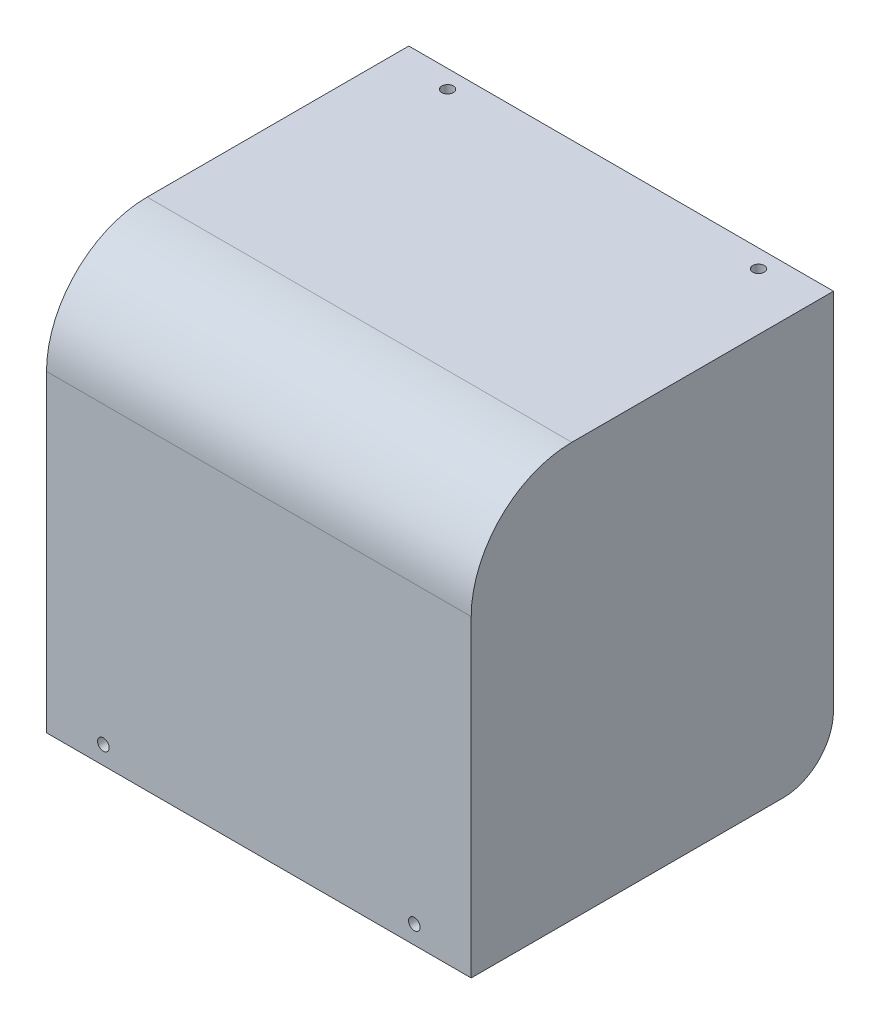
ISO-10303-21;
HEADER;
FILE_DESCRIPTION(('STEP AP214'),'2;1');
FILE_NAME('part.step','',(''),(''),'','','');
FILE_SCHEMA(('AUTOMOTIVE_DESIGN { 1 0 10303 214 1 1 1 1 }'));
ENDSEC;
DATA;
#1=APPLICATION_CONTEXT('core data for automotive mechanical design processes');
#2=APPLICATION_PROTOCOL_DEFINITION('international standard','automotive_design',2000,#1);
#3=PRODUCT_CONTEXT('',#1,'mechanical');
#4=PRODUCT('Part','Part','',(#3));
#5=PRODUCT_RELATED_PRODUCT_CATEGORY('part','',(#4));
#6=PRODUCT_DEFINITION_FORMATION('','',#4);
#7=PRODUCT_DEFINITION_CONTEXT('part definition',#1,'design');
#8=PRODUCT_DEFINITION('design','',#6,#7);
#9=PRODUCT_DEFINITION_SHAPE('','',#8);
#10=(LENGTH_UNIT() NAMED_UNIT(*) SI_UNIT(.MILLI.,.METRE.));
#11=(NAMED_UNIT(*) PLANE_ANGLE_UNIT() SI_UNIT($,.RADIAN.));
#12=(NAMED_UNIT(*) SI_UNIT($,.STERADIAN.) SOLID_ANGLE_UNIT());
#13=UNCERTAINTY_MEASURE_WITH_UNIT(LENGTH_MEASURE(1.E-05),#10,'distance_accuracy_value','');
#14=(GEOMETRIC_REPRESENTATION_CONTEXT(3) GLOBAL_UNCERTAINTY_ASSIGNED_CONTEXT((#13)) GLOBAL_UNIT_ASSIGNED_CONTEXT((#10,
#11,#12)) REPRESENTATION_CONTEXT('',''));
#15=CARTESIAN_POINT('',(0.,0.,0.));
#16=DIRECTION('',(0.,0.,1.));
#17=DIRECTION('',(1.,0.,0.));
#18=AXIS2_PLACEMENT_3D('',#15,#16,#17);
#19=CARTESIAN_POINT('',(42.2,80.2,-1.99999999999999));
#20=DIRECTION('',(0.,0.,1.));
#21=DIRECTION('',(0.,-1.,0.));
#22=AXIS2_PLACEMENT_3D('',#19,#20,#21);
#23=PLANE('',#22);
#24=CARTESIAN_POINT('',(-30.9,3.64,-2.));
#25=DIRECTION('',(0.,0.,1.));
#26=DIRECTION('',(0.,-1.,0.));
#27=AXIS2_PLACEMENT_3D('',#24,#25,#26);
#28=CIRCLE('',#27,1.15);
#29=CARTESIAN_POINT('',(-30.9,2.49,-2.));
#30=VERTEX_POINT('',#29);
#31=EDGE_CURVE('E218',#30,#30,#28,.T.);
#32=ORIENTED_EDGE('',*,*,#31,.T.);
#33=EDGE_LOOP('',(#32));
#34=FACE_BOUND('',#33,.T.);
#35=CARTESIAN_POINT('',(30.9,3.64000000000001,-2.));
#36=DIRECTION('',(0.,0.,1.));
#37=DIRECTION('',(0.,-1.,0.));
#38=AXIS2_PLACEMENT_3D('',#35,#36,#37);
#39=CIRCLE('',#38,1.15);
#40=CARTESIAN_POINT('',(30.9,2.49000000000001,-2.));
#41=VERTEX_POINT('',#40);
#42=EDGE_CURVE('E213',#41,#41,#39,.T.);
#43=ORIENTED_EDGE('',*,*,#42,.T.);
#44=EDGE_LOOP('',(#43));
#45=FACE_BOUND('',#44,.T.);
#46=DIRECTION('',(0.,1.,0.));
#47=VECTOR('',#46,1.);
#48=CARTESIAN_POINT('',(40.2,0.,-2.));
#49=LINE('',#48,#47);
#50=CARTESIAN_POINT('',(40.2,0.,-2.));
#51=VERTEX_POINT('',#50);
#52=CARTESIAN_POINT('',(40.2,60.2,-1.99999999999999));
#53=VERTEX_POINT('',#52);
#54=EDGE_CURVE('E128',#51,#53,#49,.T.);
#55=ORIENTED_EDGE('',*,*,#54,.F.);
#56=DIRECTION('',(-1.,0.,0.));
#57=VECTOR('',#56,1.);
#58=CARTESIAN_POINT('',(42.2,0.,-2.));
#59=LINE('',#58,#57);
#60=CARTESIAN_POINT('',(-40.2,0.,-2.));
#61=VERTEX_POINT('',#60);
#62=EDGE_CURVE('E193',#51,#61,#59,.T.);
#63=ORIENTED_EDGE('',*,*,#62,.T.);
#64=DIRECTION('',(0.,1.,0.));
#65=VECTOR('',#64,1.);
#66=CARTESIAN_POINT('',(-40.2,0.,-2.));
#67=LINE('',#66,#65);
#68=CARTESIAN_POINT('',(-40.2,60.2,-1.99999999999999));
#69=VERTEX_POINT('',#68);
#70=EDGE_CURVE('E205',#61,#69,#67,.T.);
#71=ORIENTED_EDGE('',*,*,#70,.T.);
#72=DIRECTION('',(-1.,0.,0.));
#73=VECTOR('',#72,1.);
#74=CARTESIAN_POINT('',(42.2,60.2,-1.99999999999999));
#75=LINE('',#74,#73);
#76=EDGE_CURVE('E145',#69,#53,#75,.F.);
#77=ORIENTED_EDGE('',*,*,#76,.T.);
#78=EDGE_LOOP('',(#55,#63,#71,#77));
#79=FACE_BOUND('',#78,.T.);
#80=ADVANCED_FACE('F35',(#34,#45,#79),#23,.F.);
#81=CARTESIAN_POINT('',(42.2,80.2,-72.));
#82=DIRECTION('',(0.,1.,0.));
#83=DIRECTION('',(0.,0.,1.));
#84=AXIS2_PLACEMENT_3D('',#81,#82,#83);
#85=PLANE('',#84);
#86=CARTESIAN_POINT('',(-30.9,80.2,-68.401968));
#87=DIRECTION('',(0.,1.,0.));
#88=DIRECTION('',(0.,0.,1.));
#89=AXIS2_PLACEMENT_3D('',#86,#87,#88);
#90=CIRCLE('',#89,1.15);
#91=CARTESIAN_POINT('',(-30.9,80.2,-67.251968));
#92=VERTEX_POINT('',#91);
#93=EDGE_CURVE('E140',#92,#92,#90,.T.);
#94=ORIENTED_EDGE('',*,*,#93,.T.);
#95=EDGE_LOOP('',(#94));
#96=FACE_BOUND('',#95,.T.);
#97=CARTESIAN_POINT('',(30.9,80.2,-68.401968));
#98=DIRECTION('',(0.,1.,0.));
#99=DIRECTION('',(0.,0.,1.));
#100=AXIS2_PLACEMENT_3D('',#97,#98,#99);
#101=CIRCLE('',#100,1.15);
#102=CARTESIAN_POINT('',(30.9,80.2,-67.251968));
#103=VERTEX_POINT('',#102);
#104=EDGE_CURVE('E333',#103,#103,#101,.T.);
#105=ORIENTED_EDGE('',*,*,#104,.T.);
#106=EDGE_LOOP('',(#105));
#107=FACE_BOUND('',#106,.T.);
#108=DIRECTION('',(0.,0.,-1.));
#109=VECTOR('',#108,1.);
#110=CARTESIAN_POINT('',(40.2,80.2,-22.));
#111=LINE('',#110,#109);
#112=CARTESIAN_POINT('',(40.2,80.2,-22.));
#113=VERTEX_POINT('',#112);
#114=CARTESIAN_POINT('',(40.2,80.2,-72.));
#115=VERTEX_POINT('',#114);
#116=EDGE_CURVE('E125',#113,#115,#111,.T.);
#117=ORIENTED_EDGE('',*,*,#116,.F.);
#118=DIRECTION('',(-1.,0.,0.));
#119=VECTOR('',#118,1.);
#120=CARTESIAN_POINT('',(-42.2,80.2,-22.));
#121=LINE('',#120,#119);
#122=CARTESIAN_POINT('',(-40.2,80.2,-22.));
#123=VERTEX_POINT('',#122);
#124=EDGE_CURVE('E137',#113,#123,#121,.T.);
#125=ORIENTED_EDGE('',*,*,#124,.T.);
#126=DIRECTION('',(0.,0.,-1.));
#127=VECTOR('',#126,1.);
#128=CARTESIAN_POINT('',(-40.2,80.2,-22.));
#129=LINE('',#128,#127);
#130=CARTESIAN_POINT('',(-40.2,80.2,-72.));
#131=VERTEX_POINT('',#130);
#132=EDGE_CURVE('E196',#123,#131,#129,.T.);
#133=ORIENTED_EDGE('',*,*,#132,.T.);
#134=DIRECTION('',(-1.,0.,0.));
#135=VECTOR('',#134,1.);
#136=CARTESIAN_POINT('',(42.2,80.2,-72.));
#137=LINE('',#136,#135);
#138=EDGE_CURVE('E139',#115,#131,#137,.T.);
#139=ORIENTED_EDGE('',*,*,#138,.F.);
#140=EDGE_LOOP('',(#117,#125,#133,#139));
#141=FACE_BOUND('',#140,.T.);
#142=ADVANCED_FACE('F135',(#96,#107,#141),#85,.F.);
#143=CARTESIAN_POINT('',(42.2,60.2,-22.));
#144=DIRECTION('',(1.,0.,0.));
#145=DIRECTION('',(0.,0.,-1.));
#146=AXIS2_PLACEMENT_3D('',#143,#144,#145);
#147=CYLINDRICAL_SURFACE('',#146,20.);
#148=CARTESIAN_POINT('',(40.2,60.2,-22.));
#149=DIRECTION('',(-1.,0.,0.));
#150=DIRECTION('',(0.,0.,1.));
#151=AXIS2_PLACEMENT_3D('',#148,#149,#150);
#152=CIRCLE('',#151,20.);
#153=EDGE_CURVE('E122',#53,#113,#152,.T.);
#154=ORIENTED_EDGE('',*,*,#153,.F.);
#155=ORIENTED_EDGE('',*,*,#76,.F.);
#156=CARTESIAN_POINT('',(-40.2,60.2,-22.));
#157=DIRECTION('',(-1.,0.,0.));
#158=DIRECTION('',(0.,0.,1.));
#159=AXIS2_PLACEMENT_3D('',#156,#157,#158);
#160=CIRCLE('',#159,20.);
#161=EDGE_CURVE('E144',#69,#123,#160,.T.);
#162=ORIENTED_EDGE('',*,*,#161,.T.);
#163=ORIENTED_EDGE('',*,*,#124,.F.);
#164=EDGE_LOOP('',(#154,#155,#162,#163));
#165=FACE_BOUND('',#164,.T.);
#166=ADVANCED_FACE('F143',(#165),#147,.F.);
#167=CARTESIAN_POINT('',(42.2,0.,-2.));
#168=DIRECTION('',(0.,1.,0.));
#169=DIRECTION('',(0.,0.,1.));
#170=AXIS2_PLACEMENT_3D('',#167,#168,#169);
#171=PLANE('',#170);
#172=DIRECTION('',(0.,0.,-1.));
#173=VECTOR('',#172,1.);
#174=CARTESIAN_POINT('',(-42.2,0.,-2.));
#175=LINE('',#174,#173);
#176=CARTESIAN_POINT('',(-42.2,0.,0.));
#177=VERTEX_POINT('',#176);
#178=CARTESIAN_POINT('',(-42.2,0.,-62.));
#179=VERTEX_POINT('',#178);
#180=EDGE_CURVE('E221',#177,#179,#175,.T.);
#181=ORIENTED_EDGE('',*,*,#180,.T.);
#182=DIRECTION('',(-1.,0.,0.));
#183=VECTOR('',#182,1.);
#184=CARTESIAN_POINT('',(42.2,0.,-62.));
#185=LINE('',#184,#183);
#186=CARTESIAN_POINT('',(-40.2,0.,-62.));
#187=VERTEX_POINT('',#186);
#188=EDGE_CURVE('E166',#179,#187,#185,.F.);
#189=ORIENTED_EDGE('',*,*,#188,.T.);
#190=DIRECTION('',(0.,0.,1.));
#191=VECTOR('',#190,1.);
#192=CARTESIAN_POINT('',(-40.2,0.,-72.));
#193=LINE('',#192,#191);
#194=EDGE_CURVE('E203',#187,#61,#193,.T.);
#195=ORIENTED_EDGE('',*,*,#194,.T.);
#196=ORIENTED_EDGE('',*,*,#62,.F.);
#197=DIRECTION('',(0.,0.,1.));
#198=VECTOR('',#197,1.);
#199=CARTESIAN_POINT('',(40.2,0.,-72.));
#200=LINE('',#199,#198);
#201=CARTESIAN_POINT('',(40.2,0.,-62.));
#202=VERTEX_POINT('',#201);
#203=EDGE_CURVE('E191',#202,#51,#200,.T.);
#204=ORIENTED_EDGE('',*,*,#203,.F.);
#205=DIRECTION('',(1.,0.,0.));
#206=VECTOR('',#205,1.);
#207=CARTESIAN_POINT('',(42.2,0.,-62.));
#208=LINE('',#207,#206);
#209=CARTESIAN_POINT('',(42.2,0.,-62.));
#210=VERTEX_POINT('',#209);
#211=EDGE_CURVE('E164',#202,#210,#208,.T.);
#212=ORIENTED_EDGE('',*,*,#211,.T.);
#213=DIRECTION('',(0.,0.,-1.));
#214=VECTOR('',#213,1.);
#215=CARTESIAN_POINT('',(42.2,0.,-2.));
#216=LINE('',#215,#214);
#217=CARTESIAN_POINT('',(42.2,0.,0.));
#218=VERTEX_POINT('',#217);
#219=EDGE_CURVE('E177',#218,#210,#216,.T.);
#220=ORIENTED_EDGE('',*,*,#219,.F.);
#221=DIRECTION('',(-1.,0.,0.));
#222=VECTOR('',#221,1.);
#223=CARTESIAN_POINT('',(42.2,0.,0.));
#224=LINE('',#223,#222);
#225=EDGE_CURVE('E227',#218,#177,#224,.T.);
#226=ORIENTED_EDGE('',*,*,#225,.T.);
#227=EDGE_LOOP('',(#181,#189,#195,#196,#204,#212,#220,#226));
#228=FACE_BOUND('',#227,.T.);
#229=ADVANCED_FACE('F188',(#228),#171,.F.);
#230=CARTESIAN_POINT('',(42.2,82.2,-72.));
#231=DIRECTION('',(0.,0.,1.));
#232=DIRECTION('',(1.,0.,0.));
#233=AXIS2_PLACEMENT_3D('',#230,#231,#232);
#234=PLANE('',#233);
#235=DIRECTION('',(0.,-1.,0.));
#236=VECTOR('',#235,1.);
#237=CARTESIAN_POINT('',(-40.2,80.2,-72.));
#238=LINE('',#237,#236);
#239=CARTESIAN_POINT('',(-40.2,9.99999999999995,-72.));
#240=VERTEX_POINT('',#239);
#241=EDGE_CURVE('E201',#131,#240,#238,.T.);
#242=ORIENTED_EDGE('',*,*,#241,.T.);
#243=DIRECTION('',(-1.,0.,0.));
#244=VECTOR('',#243,1.);
#245=CARTESIAN_POINT('',(42.2,9.99999999999995,-72.));
#246=LINE('',#245,#244);
#247=CARTESIAN_POINT('',(-42.2,9.99999999999995,-72.));
#248=VERTEX_POINT('',#247);
#249=EDGE_CURVE('E159',#240,#248,#246,.T.);
#250=ORIENTED_EDGE('',*,*,#249,.T.);
#251=DIRECTION('',(0.,1.,0.));
#252=VECTOR('',#251,1.);
#253=CARTESIAN_POINT('',(-42.2,82.2,-72.));
#254=LINE('',#253,#252);
#255=CARTESIAN_POINT('',(-42.2,82.2,-72.));
#256=VERTEX_POINT('',#255);
#257=EDGE_CURVE('E229',#248,#256,#254,.T.);
#258=ORIENTED_EDGE('',*,*,#257,.T.);
#259=DIRECTION('',(-1.,0.,0.));
#260=VECTOR('',#259,1.);
#261=CARTESIAN_POINT('',(42.2,82.2,-72.));
#262=LINE('',#261,#260);
#263=CARTESIAN_POINT('',(42.2,82.2,-72.));
#264=VERTEX_POINT('',#263);
#265=EDGE_CURVE('E182',#264,#256,#262,.T.);
#266=ORIENTED_EDGE('',*,*,#265,.F.);
#267=DIRECTION('',(0.,1.,0.));
#268=VECTOR('',#267,1.);
#269=CARTESIAN_POINT('',(42.2,82.2,-72.));
#270=LINE('',#269,#268);
#271=CARTESIAN_POINT('',(42.2,9.99999999999997,-72.));
#272=VERTEX_POINT('',#271);
#273=EDGE_CURVE('E174',#272,#264,#270,.T.);
#274=ORIENTED_EDGE('',*,*,#273,.F.);
#275=DIRECTION('',(1.,0.,0.));
#276=VECTOR('',#275,1.);
#277=CARTESIAN_POINT('',(42.2,9.99999999999997,-72.));
#278=LINE('',#277,#276);
#279=CARTESIAN_POINT('',(40.2,9.99999999999997,-72.));
#280=VERTEX_POINT('',#279);
#281=EDGE_CURVE('E157',#272,#280,#278,.F.);
#282=ORIENTED_EDGE('',*,*,#281,.T.);
#283=DIRECTION('',(0.,-1.,0.));
#284=VECTOR('',#283,1.);
#285=CARTESIAN_POINT('',(40.2,80.2,-72.));
#286=LINE('',#285,#284);
#287=EDGE_CURVE('E194',#115,#280,#286,.T.);
#288=ORIENTED_EDGE('',*,*,#287,.F.);
#289=ORIENTED_EDGE('',*,*,#138,.T.);
#290=EDGE_LOOP('',(#242,#250,#258,#266,#274,#282,#288,#289));
#291=FACE_BOUND('',#290,.T.);
#292=ADVANCED_FACE('F180',(#291),#234,.F.);
#293=CARTESIAN_POINT('',(42.2,82.2,0.));
#294=DIRECTION('',(0.,-1.,0.));
#295=DIRECTION('',(0.,0.,-1.));
#296=AXIS2_PLACEMENT_3D('',#293,#294,#295);
#297=PLANE('',#296);
#298=CARTESIAN_POINT('',(-30.9,82.2,-68.401968));
#299=DIRECTION('',(0.,1.,0.));
#300=DIRECTION('',(0.,0.,1.));
#301=AXIS2_PLACEMENT_3D('',#298,#299,#300);
#302=CIRCLE('',#301,1.15);
#303=CARTESIAN_POINT('',(-30.9,82.2,-67.251968));
#304=VERTEX_POINT('',#303);
#305=EDGE_CURVE('E327',#304,#304,#302,.T.);
#306=ORIENTED_EDGE('',*,*,#305,.F.);
#307=EDGE_LOOP('',(#306));
#308=FACE_BOUND('',#307,.T.);
#309=CARTESIAN_POINT('',(30.9,82.2,-68.401968));
#310=DIRECTION('',(0.,1.,0.));
#311=DIRECTION('',(0.,0.,1.));
#312=AXIS2_PLACEMENT_3D('',#309,#310,#311);
#313=CIRCLE('',#312,1.15);
#314=CARTESIAN_POINT('',(30.9,82.2,-67.251968));
#315=VERTEX_POINT('',#314);
#316=EDGE_CURVE('E330',#315,#315,#313,.T.);
#317=ORIENTED_EDGE('',*,*,#316,.F.);
#318=EDGE_LOOP('',(#317));
#319=FACE_BOUND('',#318,.T.);
#320=DIRECTION('',(0.,0.,1.));
#321=VECTOR('',#320,1.);
#322=CARTESIAN_POINT('',(-42.2,82.2,0.));
#323=LINE('',#322,#321);
#324=CARTESIAN_POINT('',(-42.2,82.2,-20.));
#325=VERTEX_POINT('',#324);
#326=EDGE_CURVE('E231',#256,#325,#323,.T.);
#327=ORIENTED_EDGE('',*,*,#326,.T.);
#328=DIRECTION('',(-1.,0.,0.));
#329=VECTOR('',#328,1.);
#330=CARTESIAN_POINT('',(42.2,82.2,-20.));
#331=LINE('',#330,#329);
#332=CARTESIAN_POINT('',(42.2,82.2,-20.));
#333=VERTEX_POINT('',#332);
#334=EDGE_CURVE('E146',#325,#333,#331,.F.);
#335=ORIENTED_EDGE('',*,*,#334,.T.);
#336=DIRECTION('',(0.,0.,1.));
#337=VECTOR('',#336,1.);
#338=CARTESIAN_POINT('',(42.2,82.2,0.));
#339=LINE('',#338,#337);
#340=EDGE_CURVE('E184',#264,#333,#339,.T.);
#341=ORIENTED_EDGE('',*,*,#340,.F.);
#342=ORIENTED_EDGE('',*,*,#265,.T.);
#343=EDGE_LOOP('',(#327,#335,#341,#342));
#344=FACE_BOUND('',#343,.T.);
#345=ADVANCED_FACE('F264',(#308,#319,#344),#297,.F.);
#346=CARTESIAN_POINT('',(42.2,0.,0.));
#347=DIRECTION('',(0.,0.,-1.));
#348=DIRECTION('',(-1.,0.,0.));
#349=AXIS2_PLACEMENT_3D('',#346,#347,#348);
#350=PLANE('',#349);
#351=CARTESIAN_POINT('',(-30.9,3.64,0.));
#352=DIRECTION('',(0.,0.,1.));
#353=DIRECTION('',(1.,0.,0.));
#354=AXIS2_PLACEMENT_3D('',#351,#352,#353);
#355=CIRCLE('',#354,1.15);
#356=CARTESIAN_POINT('',(-29.75,3.64,0.));
#357=VERTEX_POINT('',#356);
#358=EDGE_CURVE('E210',#357,#357,#355,.T.);
#359=ORIENTED_EDGE('',*,*,#358,.F.);
#360=EDGE_LOOP('',(#359));
#361=FACE_BOUND('',#360,.T.);
#362=CARTESIAN_POINT('',(30.9,3.64000000000001,0.));
#363=DIRECTION('',(0.,0.,1.));
#364=DIRECTION('',(1.,0.,0.));
#365=AXIS2_PLACEMENT_3D('',#362,#363,#364);
#366=CIRCLE('',#365,1.15);
#367=CARTESIAN_POINT('',(32.05,3.64000000000001,0.));
#368=VERTEX_POINT('',#367);
#369=EDGE_CURVE('E209',#368,#368,#366,.T.);
#370=ORIENTED_EDGE('',*,*,#369,.F.);
#371=EDGE_LOOP('',(#370));
#372=FACE_BOUND('',#371,.T.);
#373=DIRECTION('',(0.,-1.,0.));
#374=VECTOR('',#373,1.);
#375=CARTESIAN_POINT('',(42.2,0.,0.));
#376=LINE('',#375,#374);
#377=CARTESIAN_POINT('',(42.2,62.2,0.));
#378=VERTEX_POINT('',#377);
#379=EDGE_CURVE('E225',#378,#218,#376,.T.);
#380=ORIENTED_EDGE('',*,*,#379,.F.);
#381=DIRECTION('',(-1.,0.,0.));
#382=VECTOR('',#381,1.);
#383=CARTESIAN_POINT('',(42.2,62.2,0.));
#384=LINE('',#383,#382);
#385=CARTESIAN_POINT('',(-42.2,62.2,0.));
#386=VERTEX_POINT('',#385);
#387=EDGE_CURVE('E150',#378,#386,#384,.T.);
#388=ORIENTED_EDGE('',*,*,#387,.T.);
#389=DIRECTION('',(0.,-1.,0.));
#390=VECTOR('',#389,1.);
#391=CARTESIAN_POINT('',(-42.2,0.,0.));
#392=LINE('',#391,#390);
#393=EDGE_CURVE('E222',#386,#177,#392,.T.);
#394=ORIENTED_EDGE('',*,*,#393,.T.);
#395=ORIENTED_EDGE('',*,*,#225,.F.);
#396=EDGE_LOOP('',(#380,#388,#394,#395));
#397=FACE_BOUND('',#396,.T.);
#398=ADVANCED_FACE('F243',(#361,#372,#397),#350,.F.);
#399=CARTESIAN_POINT('',(42.2,0.,0.));
#400=DIRECTION('',(-1.,0.,0.));
#401=DIRECTION('',(0.,0.,1.));
#402=AXIS2_PLACEMENT_3D('',#399,#400,#401);
#403=PLANE('',#402);
#404=ORIENTED_EDGE('',*,*,#219,.T.);
#405=CARTESIAN_POINT('',(42.2,9.99999999999996,-62.));
#406=DIRECTION('',(-1.,0.,0.));
#407=DIRECTION('',(0.,0.,1.));
#408=AXIS2_PLACEMENT_3D('',#405,#406,#407);
#409=CIRCLE('',#408,10.);
#410=EDGE_CURVE('E43',#210,#272,#409,.F.);
#411=ORIENTED_EDGE('',*,*,#410,.T.);
#412=ORIENTED_EDGE('',*,*,#273,.T.);
#413=ORIENTED_EDGE('',*,*,#340,.T.);
#414=CARTESIAN_POINT('',(42.2,62.2,-20.));
#415=DIRECTION('',(-1.,0.,0.));
#416=DIRECTION('',(0.,0.,1.));
#417=AXIS2_PLACEMENT_3D('',#414,#415,#416);
#418=CIRCLE('',#417,20.);
#419=EDGE_CURVE('E155',#333,#378,#418,.F.);
#420=ORIENTED_EDGE('',*,*,#419,.T.);
#421=ORIENTED_EDGE('',*,*,#379,.T.);
#422=EDGE_LOOP('',(#404,#411,#412,#413,#420,#421));
#423=FACE_BOUND('',#422,.T.);
#424=ADVANCED_FACE('F172',(#423),#403,.F.);
#425=CARTESIAN_POINT('',(-42.2,0.,0.));
#426=DIRECTION('',(-1.,0.,0.));
#427=DIRECTION('',(0.,0.,1.));
#428=AXIS2_PLACEMENT_3D('',#425,#426,#427);
#429=PLANE('',#428);
#430=ORIENTED_EDGE('',*,*,#257,.F.);
#431=CARTESIAN_POINT('',(-42.2,9.99999999999995,-62.));
#432=DIRECTION('',(-1.,0.,0.));
#433=DIRECTION('',(0.,0.,1.));
#434=AXIS2_PLACEMENT_3D('',#431,#432,#433);
#435=CIRCLE('',#434,10.);
#436=EDGE_CURVE('E162',#248,#179,#435,.T.);
#437=ORIENTED_EDGE('',*,*,#436,.T.);
#438=ORIENTED_EDGE('',*,*,#180,.F.);
#439=ORIENTED_EDGE('',*,*,#393,.F.);
#440=CARTESIAN_POINT('',(-42.2,62.2,-20.));
#441=DIRECTION('',(-1.,0.,0.));
#442=DIRECTION('',(0.,0.,1.));
#443=AXIS2_PLACEMENT_3D('',#440,#441,#442);
#444=CIRCLE('',#443,20.);
#445=EDGE_CURVE('E148',#386,#325,#444,.T.);
#446=ORIENTED_EDGE('',*,*,#445,.T.);
#447=ORIENTED_EDGE('',*,*,#326,.F.);
#448=EDGE_LOOP('',(#430,#437,#438,#439,#446,#447));
#449=FACE_BOUND('',#448,.T.);
#450=ADVANCED_FACE('F250',(#449),#429,.T.);
#451=CARTESIAN_POINT('',(30.9,3.64000000000001,-70.));
#452=DIRECTION('',(0.,0.,1.));
#453=DIRECTION('',(1.,0.,0.));
#454=AXIS2_PLACEMENT_3D('',#451,#452,#453);
#455=CYLINDRICAL_SURFACE('',#454,1.15);
#456=ORIENTED_EDGE('',*,*,#369,.T.);
#457=EDGE_LOOP('',(#456));
#458=FACE_BOUND('',#457,.T.);
#459=ORIENTED_EDGE('',*,*,#42,.F.);
#460=EDGE_LOOP('',(#459));
#461=FACE_BOUND('',#460,.T.);
#462=ADVANCED_FACE('F274',(#458,#461),#455,.F.);
#463=CARTESIAN_POINT('',(-30.9,3.64,-70.));
#464=DIRECTION('',(0.,0.,1.));
#465=DIRECTION('',(1.,0.,0.));
#466=AXIS2_PLACEMENT_3D('',#463,#464,#465);
#467=CYLINDRICAL_SURFACE('',#466,1.15);
#468=ORIENTED_EDGE('',*,*,#358,.T.);
#469=EDGE_LOOP('',(#468));
#470=FACE_BOUND('',#469,.T.);
#471=ORIENTED_EDGE('',*,*,#31,.F.);
#472=EDGE_LOOP('',(#471));
#473=FACE_BOUND('',#472,.T.);
#474=ADVANCED_FACE('F267',(#470,#473),#467,.F.);
#475=CARTESIAN_POINT('',(42.2,62.2,-20.));
#476=DIRECTION('',(-1.,0.,0.));
#477=DIRECTION('',(0.,0.,1.));
#478=AXIS2_PLACEMENT_3D('',#475,#476,#477);
#479=CYLINDRICAL_SURFACE('',#478,20.);
#480=ORIENTED_EDGE('',*,*,#419,.F.);
#481=ORIENTED_EDGE('',*,*,#334,.F.);
#482=ORIENTED_EDGE('',*,*,#445,.F.);
#483=ORIENTED_EDGE('',*,*,#387,.F.);
#484=EDGE_LOOP('',(#480,#481,#482,#483));
#485=FACE_BOUND('',#484,.T.);
#486=ADVANCED_FACE('F265',(#485),#479,.T.);
#487=CARTESIAN_POINT('',(-40.2,60.2,-22.));
#488=DIRECTION('',(-1.,0.,0.));
#489=DIRECTION('',(0.,0.,1.));
#490=AXIS2_PLACEMENT_3D('',#487,#488,#489);
#491=PLANE('',#490);
#492=ORIENTED_EDGE('',*,*,#194,.F.);
#493=CARTESIAN_POINT('',(-40.2,9.99999999999995,-62.));
#494=DIRECTION('',(-1.,0.,0.));
#495=DIRECTION('',(0.,0.,1.));
#496=AXIS2_PLACEMENT_3D('',#493,#494,#495);
#497=CIRCLE('',#496,10.);
#498=EDGE_CURVE('E168',#187,#240,#497,.F.);
#499=ORIENTED_EDGE('',*,*,#498,.T.);
#500=ORIENTED_EDGE('',*,*,#241,.F.);
#501=ORIENTED_EDGE('',*,*,#132,.F.);
#502=ORIENTED_EDGE('',*,*,#161,.F.);
#503=ORIENTED_EDGE('',*,*,#70,.F.);
#504=EDGE_LOOP('',(#492,#499,#500,#501,#502,#503));
#505=FACE_BOUND('',#504,.T.);
#506=ADVANCED_FACE('F260',(#505),#491,.F.);
#507=CARTESIAN_POINT('',(40.2,60.2,-22.));
#508=DIRECTION('',(1.,0.,0.));
#509=DIRECTION('',(0.,0.,1.));
#510=AXIS2_PLACEMENT_3D('',#507,#508,#509);
#511=PLANE('',#510);
#512=ORIENTED_EDGE('',*,*,#287,.T.);
#513=CARTESIAN_POINT('',(40.2,9.99999999999996,-62.));
#514=DIRECTION('',(1.,0.,0.));
#515=DIRECTION('',(0.,0.,-1.));
#516=AXIS2_PLACEMENT_3D('',#513,#514,#515);
#517=CIRCLE('',#516,10.);
#518=EDGE_CURVE('E11',#280,#202,#517,.F.);
#519=ORIENTED_EDGE('',*,*,#518,.T.);
#520=ORIENTED_EDGE('',*,*,#203,.T.);
#521=ORIENTED_EDGE('',*,*,#54,.T.);
#522=ORIENTED_EDGE('',*,*,#153,.T.);
#523=ORIENTED_EDGE('',*,*,#116,.T.);
#524=EDGE_LOOP('',(#512,#519,#520,#521,#522,#523));
#525=FACE_BOUND('',#524,.T.);
#526=ADVANCED_FACE('F124',(#525),#511,.F.);
#527=CARTESIAN_POINT('',(42.2,9.99999999999995,-62.));
#528=DIRECTION('',(-1.,0.,0.));
#529=DIRECTION('',(0.,0.,1.));
#530=AXIS2_PLACEMENT_3D('',#527,#528,#529);
#531=CYLINDRICAL_SURFACE('',#530,10.);
#532=ORIENTED_EDGE('',*,*,#498,.F.);
#533=ORIENTED_EDGE('',*,*,#188,.F.);
#534=ORIENTED_EDGE('',*,*,#436,.F.);
#535=ORIENTED_EDGE('',*,*,#249,.F.);
#536=EDGE_LOOP('',(#532,#533,#534,#535));
#537=FACE_BOUND('',#536,.T.);
#538=ADVANCED_FACE('F256',(#537),#531,.T.);
#539=CARTESIAN_POINT('',(42.2,9.99999999999996,-62.));
#540=DIRECTION('',(1.,0.,0.));
#541=DIRECTION('',(0.,0.,-1.));
#542=AXIS2_PLACEMENT_3D('',#539,#540,#541);
#543=CYLINDRICAL_SURFACE('',#542,10.);
#544=ORIENTED_EDGE('',*,*,#518,.F.);
#545=ORIENTED_EDGE('',*,*,#281,.F.);
#546=ORIENTED_EDGE('',*,*,#410,.F.);
#547=ORIENTED_EDGE('',*,*,#211,.F.);
#548=EDGE_LOOP('',(#544,#545,#546,#547));
#549=FACE_BOUND('',#548,.T.);
#550=ADVANCED_FACE('F37',(#549),#543,.T.);
#551=CARTESIAN_POINT('',(30.9,72.2,-68.401968));
#552=DIRECTION('',(0.,1.,0.));
#553=DIRECTION('',(0.,0.,1.));
#554=AXIS2_PLACEMENT_3D('',#551,#552,#553);
#555=CYLINDRICAL_SURFACE('',#554,1.15);
#556=ORIENTED_EDGE('',*,*,#316,.T.);
#557=EDGE_LOOP('',(#556));
#558=FACE_BOUND('',#557,.T.);
#559=ORIENTED_EDGE('',*,*,#104,.F.);
#560=EDGE_LOOP('',(#559));
#561=FACE_BOUND('',#560,.T.);
#562=ADVANCED_FACE('F302',(#558,#561),#555,.F.);
#563=CARTESIAN_POINT('',(-30.9,72.2,-68.401968));
#564=DIRECTION('',(0.,1.,0.));
#565=DIRECTION('',(0.,0.,1.));
#566=AXIS2_PLACEMENT_3D('',#563,#564,#565);
#567=CYLINDRICAL_SURFACE('',#566,1.15);
#568=ORIENTED_EDGE('',*,*,#305,.T.);
#569=EDGE_LOOP('',(#568));
#570=FACE_BOUND('',#569,.T.);
#571=ORIENTED_EDGE('',*,*,#93,.F.);
#572=EDGE_LOOP('',(#571));
#573=FACE_BOUND('',#572,.T.);
#574=ADVANCED_FACE('F342',(#570,#573),#567,.F.);
#575=CLOSED_SHELL('',(#80,#142,#166,#229,#292,#345,#398,#424,#450,#462,#474,#486,#506,#526,#538,
#550,#562,#574));
#576=MANIFOLD_SOLID_BREP('B2',#575);
#577=ADVANCED_BREP_SHAPE_REPRESENTATION('',(#18,#576),#14);
#578=SHAPE_DEFINITION_REPRESENTATION(#9,#577);
ENDSEC;
END-ISO-10303-21;
